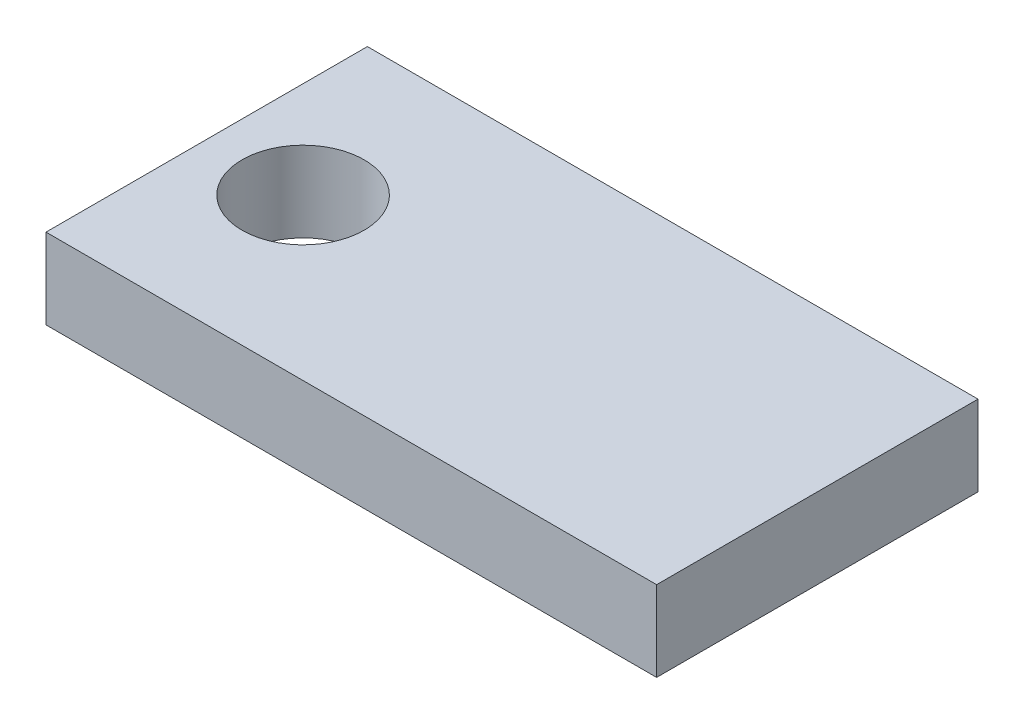
ISO-10303-21;
HEADER;
FILE_DESCRIPTION(('STEP AP214'),'2;1');
FILE_NAME('part.step','',(''),(''),'','','');
FILE_SCHEMA(('AUTOMOTIVE_DESIGN { 1 0 10303 214 1 1 1 1 }'));
ENDSEC;
DATA;
#1=APPLICATION_CONTEXT('core data for automotive mechanical design processes');
#2=APPLICATION_PROTOCOL_DEFINITION('international standard','automotive_design',2000,#1);
#3=PRODUCT_CONTEXT('',#1,'mechanical');
#4=PRODUCT('Part','Part','',(#3));
#5=PRODUCT_RELATED_PRODUCT_CATEGORY('part','',(#4));
#6=PRODUCT_DEFINITION_FORMATION('','',#4);
#7=PRODUCT_DEFINITION_CONTEXT('part definition',#1,'design');
#8=PRODUCT_DEFINITION('design','',#6,#7);
#9=PRODUCT_DEFINITION_SHAPE('','',#8);
#10=(LENGTH_UNIT() NAMED_UNIT(*) SI_UNIT(.MILLI.,.METRE.));
#11=(NAMED_UNIT(*) PLANE_ANGLE_UNIT() SI_UNIT($,.RADIAN.));
#12=(NAMED_UNIT(*) SI_UNIT($,.STERADIAN.) SOLID_ANGLE_UNIT());
#13=UNCERTAINTY_MEASURE_WITH_UNIT(LENGTH_MEASURE(1.E-05),#10,'distance_accuracy_value','');
#14=(GEOMETRIC_REPRESENTATION_CONTEXT(3) GLOBAL_UNCERTAINTY_ASSIGNED_CONTEXT((#13)) GLOBAL_UNIT_ASSIGNED_CONTEXT((#10,
#11,#12)) REPRESENTATION_CONTEXT('',''));
#15=CARTESIAN_POINT('',(0.,0.,0.));
#16=DIRECTION('',(0.,0.,1.));
#17=DIRECTION('',(1.,0.,0.));
#18=AXIS2_PLACEMENT_3D('',#15,#16,#17);
#19=CARTESIAN_POINT('',(-24.13,6.35,12.7));
#20=DIRECTION('',(1.,0.,0.));
#21=DIRECTION('',(0.,0.,-1.));
#22=AXIS2_PLACEMENT_3D('',#19,#20,#21);
#23=PLANE('',#22);
#24=DIRECTION('',(0.,0.,1.));
#25=VECTOR('',#24,1.);
#26=CARTESIAN_POINT('',(-24.13,0.,12.7));
#27=LINE('',#26,#25);
#28=CARTESIAN_POINT('',(-24.13,0.,-12.7));
#29=VERTEX_POINT('',#28);
#30=CARTESIAN_POINT('',(-24.13,0.,12.7));
#31=VERTEX_POINT('',#30);
#32=EDGE_CURVE('E99',#29,#31,#27,.T.);
#33=ORIENTED_EDGE('',*,*,#32,.T.);
#34=DIRECTION('',(0.,-1.,0.));
#35=VECTOR('',#34,1.);
#36=CARTESIAN_POINT('',(-24.13,6.35,12.7));
#37=LINE('',#36,#35);
#38=CARTESIAN_POINT('',(-24.13,6.35,12.7));
#39=VERTEX_POINT('',#38);
#40=EDGE_CURVE('E11',#39,#31,#37,.T.);
#41=ORIENTED_EDGE('',*,*,#40,.F.);
#42=DIRECTION('',(0.,0.,1.));
#43=VECTOR('',#42,1.);
#44=CARTESIAN_POINT('',(-24.13,6.35,12.7));
#45=LINE('',#44,#43);
#46=CARTESIAN_POINT('',(-24.13,6.35,-12.7));
#47=VERTEX_POINT('',#46);
#48=EDGE_CURVE('E86',#47,#39,#45,.T.);
#49=ORIENTED_EDGE('',*,*,#48,.F.);
#50=DIRECTION('',(0.,-1.,0.));
#51=VECTOR('',#50,1.);
#52=CARTESIAN_POINT('',(-24.13,6.35,-12.7));
#53=LINE('',#52,#51);
#54=EDGE_CURVE('E95',#47,#29,#53,.T.);
#55=ORIENTED_EDGE('',*,*,#54,.T.);
#56=EDGE_LOOP('',(#33,#41,#49,#55));
#57=FACE_BOUND('',#56,.T.);
#58=ADVANCED_FACE('F34',(#57),#23,.F.);
#59=CARTESIAN_POINT('',(24.13,6.35,12.7));
#60=DIRECTION('',(0.,0.,-1.));
#61=DIRECTION('',(-1.,0.,0.));
#62=AXIS2_PLACEMENT_3D('',#59,#60,#61);
#63=PLANE('',#62);
#64=DIRECTION('',(1.,0.,0.));
#65=VECTOR('',#64,1.);
#66=CARTESIAN_POINT('',(24.13,0.,12.7));
#67=LINE('',#66,#65);
#68=CARTESIAN_POINT('',(24.13,0.,12.7));
#69=VERTEX_POINT('',#68);
#70=EDGE_CURVE('E90',#31,#69,#67,.T.);
#71=ORIENTED_EDGE('',*,*,#70,.T.);
#72=DIRECTION('',(0.,-1.,0.));
#73=VECTOR('',#72,1.);
#74=CARTESIAN_POINT('',(24.13,6.35,12.7));
#75=LINE('',#74,#73);
#76=CARTESIAN_POINT('',(24.13,6.35,12.7));
#77=VERTEX_POINT('',#76);
#78=EDGE_CURVE('E43',#77,#69,#75,.T.);
#79=ORIENTED_EDGE('',*,*,#78,.F.);
#80=DIRECTION('',(1.,0.,0.));
#81=VECTOR('',#80,1.);
#82=CARTESIAN_POINT('',(24.13,6.35,12.7));
#83=LINE('',#82,#81);
#84=EDGE_CURVE('E81',#39,#77,#83,.T.);
#85=ORIENTED_EDGE('',*,*,#84,.F.);
#86=ORIENTED_EDGE('',*,*,#40,.T.);
#87=EDGE_LOOP('',(#71,#79,#85,#86));
#88=FACE_BOUND('',#87,.T.);
#89=ADVANCED_FACE('F89',(#88),#63,.F.);
#90=CARTESIAN_POINT('',(24.13,6.35,12.7));
#91=DIRECTION('',(-1.,0.,0.));
#92=DIRECTION('',(0.,0.,1.));
#93=AXIS2_PLACEMENT_3D('',#90,#91,#92);
#94=PLANE('',#93);
#95=DIRECTION('',(0.,0.,-1.));
#96=VECTOR('',#95,1.);
#97=CARTESIAN_POINT('',(24.13,0.,12.7));
#98=LINE('',#97,#96);
#99=CARTESIAN_POINT('',(24.13,0.,-12.7));
#100=VERTEX_POINT('',#99);
#101=EDGE_CURVE('E68',#69,#100,#98,.T.);
#102=ORIENTED_EDGE('',*,*,#101,.T.);
#103=DIRECTION('',(0.,-1.,0.));
#104=VECTOR('',#103,1.);
#105=CARTESIAN_POINT('',(24.13,6.35,-12.7));
#106=LINE('',#105,#104);
#107=CARTESIAN_POINT('',(24.13,6.35,-12.7));
#108=VERTEX_POINT('',#107);
#109=EDGE_CURVE('E91',#108,#100,#106,.T.);
#110=ORIENTED_EDGE('',*,*,#109,.F.);
#111=DIRECTION('',(0.,0.,-1.));
#112=VECTOR('',#111,1.);
#113=CARTESIAN_POINT('',(24.13,6.35,12.7));
#114=LINE('',#113,#112);
#115=EDGE_CURVE('E84',#77,#108,#114,.T.);
#116=ORIENTED_EDGE('',*,*,#115,.F.);
#117=ORIENTED_EDGE('',*,*,#78,.T.);
#118=EDGE_LOOP('',(#102,#110,#116,#117));
#119=FACE_BOUND('',#118,.T.);
#120=ADVANCED_FACE('F93',(#119),#94,.F.);
#121=CARTESIAN_POINT('',(24.13,6.35,-12.7));
#122=DIRECTION('',(0.,0.,1.));
#123=DIRECTION('',(1.,0.,0.));
#124=AXIS2_PLACEMENT_3D('',#121,#122,#123);
#125=PLANE('',#124);
#126=DIRECTION('',(-1.,0.,0.));
#127=VECTOR('',#126,1.);
#128=CARTESIAN_POINT('',(24.13,0.,-12.7));
#129=LINE('',#128,#127);
#130=EDGE_CURVE('E74',#100,#29,#129,.T.);
#131=ORIENTED_EDGE('',*,*,#130,.T.);
#132=ORIENTED_EDGE('',*,*,#54,.F.);
#133=DIRECTION('',(-1.,0.,0.));
#134=VECTOR('',#133,1.);
#135=CARTESIAN_POINT('',(24.13,6.35,-12.7));
#136=LINE('',#135,#134);
#137=EDGE_CURVE('E51',#108,#47,#136,.T.);
#138=ORIENTED_EDGE('',*,*,#137,.F.);
#139=ORIENTED_EDGE('',*,*,#109,.T.);
#140=EDGE_LOOP('',(#131,#132,#138,#139));
#141=FACE_BOUND('',#140,.T.);
#142=ADVANCED_FACE('F106',(#141),#125,.F.);
#143=CARTESIAN_POINT('',(0.,6.35,0.));
#144=DIRECTION('',(0.,1.,0.));
#145=DIRECTION('',(0.,0.,1.));
#146=AXIS2_PLACEMENT_3D('',#143,#144,#145);
#147=PLANE('',#146);
#148=CARTESIAN_POINT('',(-16.51,6.35,0.));
#149=DIRECTION('',(0.,1.,0.));
#150=DIRECTION('',(0.,0.,1.));
#151=AXIS2_PLACEMENT_3D('',#148,#149,#150);
#152=CIRCLE('',#151,4.826);
#153=CARTESIAN_POINT('',(-16.51,6.35,4.826));
#154=VERTEX_POINT('',#153);
#155=EDGE_CURVE('E112',#154,#154,#152,.T.);
#156=ORIENTED_EDGE('',*,*,#155,.F.);
#157=EDGE_LOOP('',(#156));
#158=FACE_BOUND('',#157,.T.);
#159=ORIENTED_EDGE('',*,*,#48,.T.);
#160=ORIENTED_EDGE('',*,*,#84,.T.);
#161=ORIENTED_EDGE('',*,*,#115,.T.);
#162=ORIENTED_EDGE('',*,*,#137,.T.);
#163=EDGE_LOOP('',(#159,#160,#161,#162));
#164=FACE_BOUND('',#163,.T.);
#165=ADVANCED_FACE('F82',(#158,#164),#147,.T.);
#166=CARTESIAN_POINT('',(0.,0.,0.));
#167=DIRECTION('',(0.,1.,0.));
#168=DIRECTION('',(0.,0.,1.));
#169=AXIS2_PLACEMENT_3D('',#166,#167,#168);
#170=PLANE('',#169);
#171=CARTESIAN_POINT('',(-16.51,0.,0.));
#172=DIRECTION('',(0.,1.,0.));
#173=DIRECTION('',(0.,0.,1.));
#174=AXIS2_PLACEMENT_3D('',#171,#172,#173);
#175=CIRCLE('',#174,4.826);
#176=CARTESIAN_POINT('',(-16.51,0.,4.826));
#177=VERTEX_POINT('',#176);
#178=EDGE_CURVE('E37',#177,#177,#175,.T.);
#179=ORIENTED_EDGE('',*,*,#178,.T.);
#180=EDGE_LOOP('',(#179));
#181=FACE_BOUND('',#180,.T.);
#182=ORIENTED_EDGE('',*,*,#32,.F.);
#183=ORIENTED_EDGE('',*,*,#130,.F.);
#184=ORIENTED_EDGE('',*,*,#101,.F.);
#185=ORIENTED_EDGE('',*,*,#70,.F.);
#186=EDGE_LOOP('',(#182,#183,#184,#185));
#187=FACE_BOUND('',#186,.T.);
#188=ADVANCED_FACE('F109',(#181,#187),#170,.F.);
#189=CARTESIAN_POINT('',(-16.51,-2.54,0.));
#190=DIRECTION('',(0.,1.,0.));
#191=DIRECTION('',(0.,0.,1.));
#192=AXIS2_PLACEMENT_3D('',#189,#190,#191);
#193=CYLINDRICAL_SURFACE('',#192,4.826);
#194=ORIENTED_EDGE('',*,*,#155,.T.);
#195=EDGE_LOOP('',(#194));
#196=FACE_BOUND('',#195,.T.);
#197=ORIENTED_EDGE('',*,*,#178,.F.);
#198=EDGE_LOOP('',(#197));
#199=FACE_BOUND('',#198,.T.);
#200=ADVANCED_FACE('F120',(#196,#199),#193,.F.);
#201=CLOSED_SHELL('',(#58,#89,#120,#142,#165,#188,#200));
#202=MANIFOLD_SOLID_BREP('B2',#201);
#203=ADVANCED_BREP_SHAPE_REPRESENTATION('',(#18,#202),#14);
#204=SHAPE_DEFINITION_REPRESENTATION(#9,#203);
ENDSEC;
END-ISO-10303-21;
